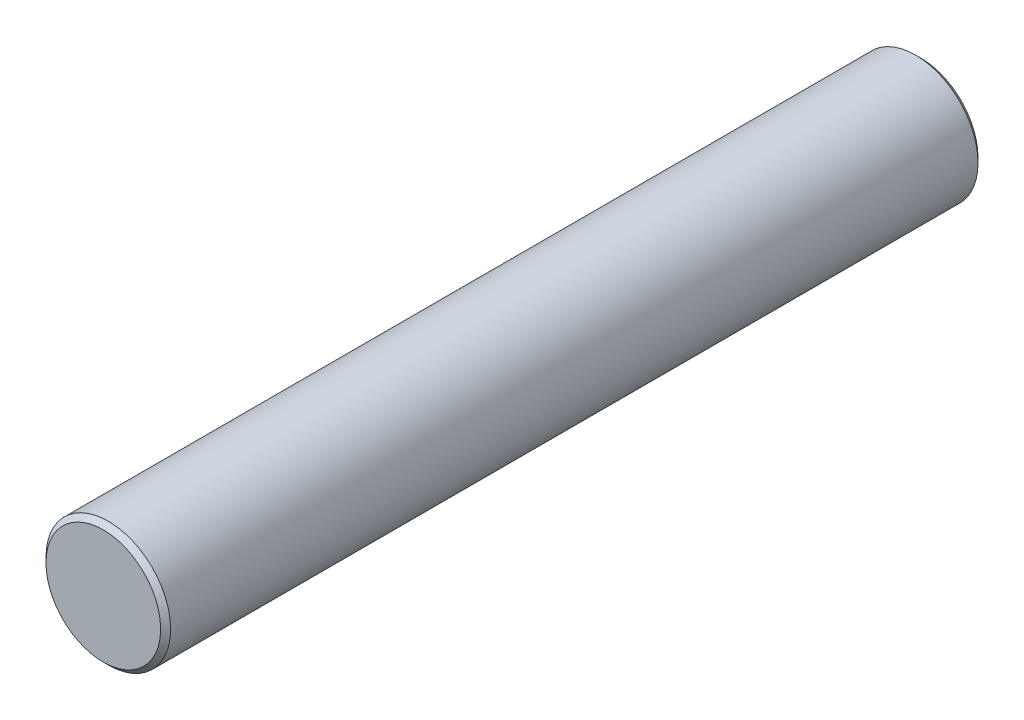
ISO-10303-21;
HEADER;
FILE_DESCRIPTION(('STEP AP214'),'2;1');
FILE_NAME('part.step','',(''),(''),'','','');
FILE_SCHEMA(('AUTOMOTIVE_DESIGN { 1 0 10303 214 1 1 1 1 }'));
ENDSEC;
DATA;
#1=APPLICATION_CONTEXT('core data for automotive mechanical design processes');
#2=APPLICATION_PROTOCOL_DEFINITION('international standard','automotive_design',2000,#1);
#3=PRODUCT_CONTEXT('',#1,'mechanical');
#4=PRODUCT('Part','Part','',(#3));
#5=PRODUCT_RELATED_PRODUCT_CATEGORY('part','',(#4));
#6=PRODUCT_DEFINITION_FORMATION('','',#4);
#7=PRODUCT_DEFINITION_CONTEXT('part definition',#1,'design');
#8=PRODUCT_DEFINITION('design','',#6,#7);
#9=PRODUCT_DEFINITION_SHAPE('','',#8);
#10=(LENGTH_UNIT() NAMED_UNIT(*) SI_UNIT(.MILLI.,.METRE.));
#11=(NAMED_UNIT(*) PLANE_ANGLE_UNIT() SI_UNIT($,.RADIAN.));
#12=(NAMED_UNIT(*) SI_UNIT($,.STERADIAN.) SOLID_ANGLE_UNIT());
#13=UNCERTAINTY_MEASURE_WITH_UNIT(LENGTH_MEASURE(1.E-05),#10,'distance_accuracy_value','');
#14=(GEOMETRIC_REPRESENTATION_CONTEXT(3) GLOBAL_UNCERTAINTY_ASSIGNED_CONTEXT((#13)) GLOBAL_UNIT_ASSIGNED_CONTEXT((#10,
#11,#12)) REPRESENTATION_CONTEXT('',''));
#15=CARTESIAN_POINT('',(0.,0.,0.));
#16=DIRECTION('',(0.,0.,1.));
#17=DIRECTION('',(1.,0.,0.));
#18=AXIS2_PLACEMENT_3D('',#15,#16,#17);
#19=CARTESIAN_POINT('',(0.,0.,29.8082561210692));
#20=DIRECTION('',(0.,0.,-1.));
#21=DIRECTION('',(-1.,0.,0.));
#22=AXIS2_PLACEMENT_3D('',#19,#20,#21);
#23=CYLINDRICAL_SURFACE('',#22,3.175);
#24=CARTESIAN_POINT('',(0.,0.,-20.574));
#25=DIRECTION('',(0.,0.,1.));
#26=DIRECTION('',(1.,0.,0.));
#27=AXIS2_PLACEMENT_3D('',#24,#25,#26);
#28=CIRCLE('',#27,3.175);
#29=CARTESIAN_POINT('',(3.175,0.,-20.574));
#30=VERTEX_POINT('',#29);
#31=EDGE_CURVE('E20',#30,#30,#28,.T.);
#32=ORIENTED_EDGE('',*,*,#31,.T.);
#33=EDGE_LOOP('',(#32));
#34=FACE_BOUND('',#33,.T.);
#35=CARTESIAN_POINT('',(0.,0.,20.574));
#36=DIRECTION('',(0.,0.,-1.));
#37=DIRECTION('',(-1.,0.,0.));
#38=AXIS2_PLACEMENT_3D('',#35,#36,#37);
#39=CIRCLE('',#38,3.175);
#40=CARTESIAN_POINT('',(-3.175,0.,20.574));
#41=VERTEX_POINT('',#40);
#42=EDGE_CURVE('E24',#41,#41,#39,.T.);
#43=ORIENTED_EDGE('',*,*,#42,.T.);
#44=EDGE_LOOP('',(#43));
#45=FACE_BOUND('',#44,.T.);
#46=ADVANCED_FACE('F14',(#34,#45),#23,.T.);
#47=CARTESIAN_POINT('',(-6.35000000000157,3.302,20.828));
#48=DIRECTION('',(0.,0.,-1.));
#49=DIRECTION('',(-1.,0.,0.));
#50=AXIS2_PLACEMENT_3D('',#47,#48,#49);
#51=PLANE('',#50);
#52=CARTESIAN_POINT('',(0.,0.,20.828));
#53=DIRECTION('',(0.,0.,-1.));
#54=DIRECTION('',(-1.,0.,0.));
#55=AXIS2_PLACEMENT_3D('',#52,#53,#54);
#56=CIRCLE('',#55,2.92099999999998);
#57=CARTESIAN_POINT('',(-2.92099999999998,0.,20.828));
#58=VERTEX_POINT('',#57);
#59=EDGE_CURVE('E9',#58,#58,#56,.F.);
#60=ORIENTED_EDGE('',*,*,#59,.T.);
#61=EDGE_LOOP('',(#60));
#62=FACE_BOUND('',#61,.T.);
#63=ADVANCED_FACE('F48',(#62),#51,.F.);
#64=CARTESIAN_POINT('',(-6.35000000000157,3.30200000000001,-20.828));
#65=DIRECTION('',(0.,0.,1.));
#66=DIRECTION('',(0.,-1.,0.));
#67=AXIS2_PLACEMENT_3D('',#64,#65,#66);
#68=PLANE('',#67);
#69=CARTESIAN_POINT('',(0.,0.,-20.828));
#70=DIRECTION('',(0.,0.,1.));
#71=DIRECTION('',(0.,-1.,0.));
#72=AXIS2_PLACEMENT_3D('',#69,#70,#71);
#73=CIRCLE('',#72,2.92100000000001);
#74=CARTESIAN_POINT('',(0.,-2.92100000000001,-20.828));
#75=VERTEX_POINT('',#74);
#76=EDGE_CURVE('E28',#75,#75,#73,.F.);
#77=ORIENTED_EDGE('',*,*,#76,.T.);
#78=EDGE_LOOP('',(#77));
#79=FACE_BOUND('',#78,.T.);
#80=ADVANCED_FACE('F34',(#79),#68,.F.);
#81=CARTESIAN_POINT('',(0.,0.,-20.828));
#82=DIRECTION('',(0.,0.,1.));
#83=DIRECTION('',(1.,0.,0.));
#84=AXIS2_PLACEMENT_3D('',#81,#82,#83);
#85=CONICAL_SURFACE('',#84,2.92100000000001,0.78539816339745);
#86=ORIENTED_EDGE('',*,*,#31,.F.);
#87=EDGE_LOOP('',(#86));
#88=FACE_BOUND('',#87,.T.);
#89=ORIENTED_EDGE('',*,*,#76,.F.);
#90=EDGE_LOOP('',(#89));
#91=FACE_BOUND('',#90,.T.);
#92=ADVANCED_FACE('F36',(#88,#91),#85,.T.);
#93=CARTESIAN_POINT('',(0.,0.,20.574));
#94=DIRECTION('',(0.,0.,-1.));
#95=DIRECTION('',(-1.,0.,0.));
#96=AXIS2_PLACEMENT_3D('',#93,#94,#95);
#97=CONICAL_SURFACE('',#96,3.175,0.78539816339745);
#98=ORIENTED_EDGE('',*,*,#59,.F.);
#99=EDGE_LOOP('',(#98));
#100=FACE_BOUND('',#99,.T.);
#101=ORIENTED_EDGE('',*,*,#42,.F.);
#102=EDGE_LOOP('',(#101));
#103=FACE_BOUND('',#102,.T.);
#104=ADVANCED_FACE('F38',(#100,#103),#97,.T.);
#105=CLOSED_SHELL('',(#46,#63,#80,#92,#104));
#106=MANIFOLD_SOLID_BREP('B1',#105);
#107=ADVANCED_BREP_SHAPE_REPRESENTATION('',(#18,#106),#14);
#108=SHAPE_DEFINITION_REPRESENTATION(#9,#107);
ENDSEC;
END-ISO-10303-21;
